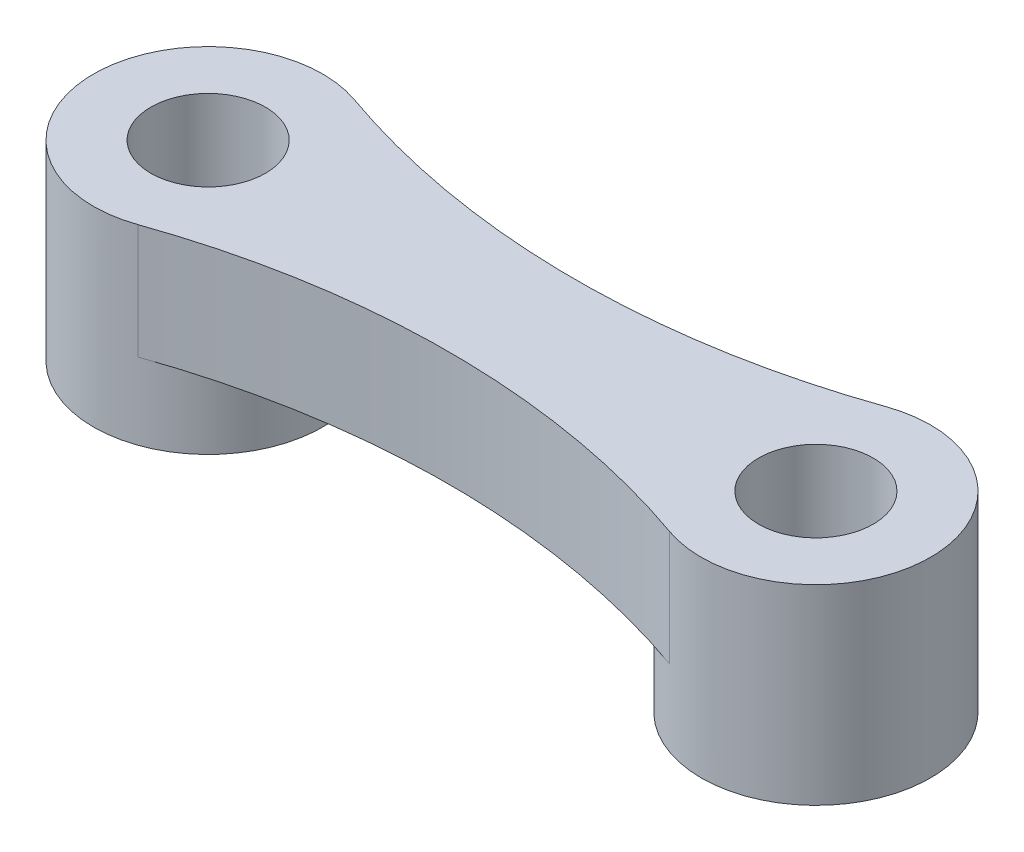
ISO-10303-21;
HEADER;
FILE_DESCRIPTION(('STEP AP214'),'2;1');
FILE_NAME('part.step','',(''),(''),'','','');
FILE_SCHEMA(('AUTOMOTIVE_DESIGN { 1 0 10303 214 1 1 1 1 }'));
ENDSEC;
DATA;
#1=APPLICATION_CONTEXT('core data for automotive mechanical design processes');
#2=APPLICATION_PROTOCOL_DEFINITION('international standard','automotive_design',2000,#1);
#3=PRODUCT_CONTEXT('',#1,'mechanical');
#4=PRODUCT('Part','Part','',(#3));
#5=PRODUCT_RELATED_PRODUCT_CATEGORY('part','',(#4));
#6=PRODUCT_DEFINITION_FORMATION('','',#4);
#7=PRODUCT_DEFINITION_CONTEXT('part definition',#1,'design');
#8=PRODUCT_DEFINITION('design','',#6,#7);
#9=PRODUCT_DEFINITION_SHAPE('','',#8);
#10=(LENGTH_UNIT() NAMED_UNIT(*) SI_UNIT(.MILLI.,.METRE.));
#11=(NAMED_UNIT(*) PLANE_ANGLE_UNIT() SI_UNIT($,.RADIAN.));
#12=(NAMED_UNIT(*) SI_UNIT($,.STERADIAN.) SOLID_ANGLE_UNIT());
#13=UNCERTAINTY_MEASURE_WITH_UNIT(LENGTH_MEASURE(1.E-05),#10,'distance_accuracy_value','');
#14=(GEOMETRIC_REPRESENTATION_CONTEXT(3) GLOBAL_UNCERTAINTY_ASSIGNED_CONTEXT((#13)) GLOBAL_UNIT_ASSIGNED_CONTEXT((#10,
#11,#12)) REPRESENTATION_CONTEXT('',''));
#15=CARTESIAN_POINT('',(0.,0.,0.));
#16=DIRECTION('',(0.,0.,1.));
#17=DIRECTION('',(1.,0.,0.));
#18=AXIS2_PLACEMENT_3D('',#15,#16,#17);
#19=CARTESIAN_POINT('',(-7.95,3.,0.));
#20=DIRECTION('',(0.,1.,0.));
#21=DIRECTION('',(0.,0.,1.));
#22=AXIS2_PLACEMENT_3D('',#19,#20,#21);
#23=PLANE('',#22);
#24=CARTESIAN_POINT('',(-7.95,3.,0.));
#25=DIRECTION('',(0.,1.,0.));
#26=DIRECTION('',(0.,0.,1.));
#27=AXIS2_PLACEMENT_3D('',#24,#25,#26);
#28=CIRCLE('',#27,1.5);
#29=CARTESIAN_POINT('',(-7.95,3.,1.5));
#30=VERTEX_POINT('',#29);
#31=EDGE_CURVE('E167',#30,#30,#28,.T.);
#32=ORIENTED_EDGE('',*,*,#31,.F.);
#33=EDGE_LOOP('',(#32));
#34=FACE_BOUND('',#33,.T.);
#35=CARTESIAN_POINT('',(7.95,3.,0.));
#36=DIRECTION('',(0.,1.,0.));
#37=DIRECTION('',(0.,0.,1.));
#38=AXIS2_PLACEMENT_3D('',#35,#36,#37);
#39=CIRCLE('',#38,1.5);
#40=CARTESIAN_POINT('',(7.95,3.,1.5));
#41=VERTEX_POINT('',#40);
#42=EDGE_CURVE('E160',#41,#41,#39,.T.);
#43=ORIENTED_EDGE('',*,*,#42,.F.);
#44=EDGE_LOOP('',(#43));
#45=FACE_BOUND('',#44,.T.);
#46=CARTESIAN_POINT('',(7.95,3.,0.));
#47=DIRECTION('',(0.,1.,0.));
#48=DIRECTION('',(0.,0.,1.));
#49=AXIS2_PLACEMENT_3D('',#46,#47,#48);
#50=CIRCLE('',#49,3.);
#51=CARTESIAN_POINT('',(6.95625,3.,2.83062907098404));
#52=VERTEX_POINT('',#51);
#53=CARTESIAN_POINT('',(6.95625000000001,3.,-2.83062907098404));
#54=VERTEX_POINT('',#53);
#55=EDGE_CURVE('E13',#52,#54,#50,.T.);
#56=ORIENTED_EDGE('',*,*,#55,.T.);
#57=CARTESIAN_POINT('',(0.,3.,-22.6450325678724));
#58=DIRECTION('',(0.,-1.,0.));
#59=DIRECTION('',(0.,0.,1.));
#60=AXIS2_PLACEMENT_3D('',#57,#58,#59);
#61=CIRCLE('',#60,21.);
#62=CARTESIAN_POINT('',(-6.95625,3.,-2.83062907098405));
#63=VERTEX_POINT('',#62);
#64=EDGE_CURVE('E152',#54,#63,#61,.T.);
#65=ORIENTED_EDGE('',*,*,#64,.T.);
#66=CARTESIAN_POINT('',(-7.95,3.,0.));
#67=DIRECTION('',(0.,1.,0.));
#68=DIRECTION('',(0.,0.,1.));
#69=AXIS2_PLACEMENT_3D('',#66,#67,#68);
#70=CIRCLE('',#69,3.);
#71=CARTESIAN_POINT('',(-6.95625,3.,2.83062907098405));
#72=VERTEX_POINT('',#71);
#73=EDGE_CURVE('E86',#63,#72,#70,.T.);
#74=ORIENTED_EDGE('',*,*,#73,.T.);
#75=CARTESIAN_POINT('',(0.,3.,22.6450325678724));
#76=DIRECTION('',(0.,-1.,0.));
#77=DIRECTION('',(0.,0.,-1.));
#78=AXIS2_PLACEMENT_3D('',#75,#76,#77);
#79=CIRCLE('',#78,21.);
#80=EDGE_CURVE('E148',#72,#52,#79,.T.);
#81=ORIENTED_EDGE('',*,*,#80,.T.);
#82=EDGE_LOOP('',(#56,#65,#74,#81));
#83=FACE_BOUND('',#82,.T.);
#84=ADVANCED_FACE('F77',(#34,#45,#83),#23,.T.);
#85=CARTESIAN_POINT('',(-7.95,0.,0.));
#86=DIRECTION('',(0.,1.,0.));
#87=DIRECTION('',(0.,0.,1.));
#88=AXIS2_PLACEMENT_3D('',#85,#86,#87);
#89=PLANE('',#88);
#90=CARTESIAN_POINT('',(0.,0.,-22.6450325678724));
#91=DIRECTION('',(0.,-1.,0.));
#92=DIRECTION('',(0.,0.,1.));
#93=AXIS2_PLACEMENT_3D('',#90,#91,#92);
#94=CIRCLE('',#93,21.);
#95=CARTESIAN_POINT('',(6.95625000000001,0.,-2.83062907098404));
#96=VERTEX_POINT('',#95);
#97=CARTESIAN_POINT('',(-6.95625,0.,-2.83062907098405));
#98=VERTEX_POINT('',#97);
#99=EDGE_CURVE('E122',#96,#98,#94,.T.);
#100=ORIENTED_EDGE('',*,*,#99,.F.);
#101=CARTESIAN_POINT('',(7.95,0.,0.));
#102=DIRECTION('',(0.,1.,0.));
#103=DIRECTION('',(0.,0.,1.));
#104=AXIS2_PLACEMENT_3D('',#101,#102,#103);
#105=CIRCLE('',#104,3.);
#106=CARTESIAN_POINT('',(6.95625,0.,2.83062907098405));
#107=VERTEX_POINT('',#106);
#108=EDGE_CURVE('E116',#96,#107,#105,.T.);
#109=ORIENTED_EDGE('',*,*,#108,.T.);
#110=CARTESIAN_POINT('',(0.,0.,22.6450325678724));
#111=DIRECTION('',(0.,-1.,0.));
#112=DIRECTION('',(0.,0.,-1.));
#113=AXIS2_PLACEMENT_3D('',#110,#111,#112);
#114=CIRCLE('',#113,21.);
#115=CARTESIAN_POINT('',(-6.95625,0.,2.83062907098405));
#116=VERTEX_POINT('',#115);
#117=EDGE_CURVE('E120',#116,#107,#114,.T.);
#118=ORIENTED_EDGE('',*,*,#117,.F.);
#119=CARTESIAN_POINT('',(-7.95,0.,0.));
#120=DIRECTION('',(0.,1.,0.));
#121=DIRECTION('',(0.,0.,1.));
#122=AXIS2_PLACEMENT_3D('',#119,#120,#121);
#123=CIRCLE('',#122,3.);
#124=EDGE_CURVE('E93',#116,#98,#123,.T.);
#125=ORIENTED_EDGE('',*,*,#124,.T.);
#126=EDGE_LOOP('',(#100,#109,#118,#125));
#127=FACE_BOUND('',#126,.T.);
#128=ADVANCED_FACE('F118',(#127),#89,.F.);
#129=CARTESIAN_POINT('',(-7.95,3.,0.));
#130=DIRECTION('',(0.,-1.,0.));
#131=DIRECTION('',(0.,0.,-1.));
#132=AXIS2_PLACEMENT_3D('',#129,#130,#131);
#133=CYLINDRICAL_SURFACE('',#132,3.);
#134=DIRECTION('',(0.,1.,0.));
#135=VECTOR('',#134,1.);
#136=CARTESIAN_POINT('',(-6.95625,0.,-2.83062907098405));
#137=LINE('',#136,#135);
#138=EDGE_CURVE('E143',#98,#63,#137,.T.);
#139=ORIENTED_EDGE('',*,*,#138,.F.);
#140=ORIENTED_EDGE('',*,*,#124,.F.);
#141=DIRECTION('',(0.,1.,0.));
#142=VECTOR('',#141,1.);
#143=CARTESIAN_POINT('',(-6.95625,0.,2.83062907098405));
#144=LINE('',#143,#142);
#145=EDGE_CURVE('E139',#116,#72,#144,.T.);
#146=ORIENTED_EDGE('',*,*,#145,.T.);
#147=ORIENTED_EDGE('',*,*,#73,.F.);
#148=EDGE_LOOP('',(#139,#140,#146,#147));
#149=FACE_BOUND('',#148,.T.);
#150=CARTESIAN_POINT('',(-7.95,-2.,0.));
#151=DIRECTION('',(0.,1.,0.));
#152=DIRECTION('',(0.,0.,1.));
#153=AXIS2_PLACEMENT_3D('',#150,#151,#152);
#154=CIRCLE('',#153,3.);
#155=CARTESIAN_POINT('',(-7.95,-2.,3.));
#156=VERTEX_POINT('',#155);
#157=EDGE_CURVE('E156',#156,#156,#154,.T.);
#158=ORIENTED_EDGE('',*,*,#157,.T.);
#159=EDGE_LOOP('',(#158));
#160=FACE_BOUND('',#159,.T.);
#161=ADVANCED_FACE('F79',(#149,#160),#133,.T.);
#162=CARTESIAN_POINT('',(7.95,3.,0.));
#163=DIRECTION('',(0.,-1.,0.));
#164=DIRECTION('',(0.,0.,-1.));
#165=AXIS2_PLACEMENT_3D('',#162,#163,#164);
#166=CYLINDRICAL_SURFACE('',#165,3.);
#167=DIRECTION('',(0.,1.,0.));
#168=VECTOR('',#167,1.);
#169=CARTESIAN_POINT('',(6.95625,0.,2.83062907098404));
#170=LINE('',#169,#168);
#171=EDGE_CURVE('E131',#107,#52,#170,.T.);
#172=ORIENTED_EDGE('',*,*,#171,.F.);
#173=ORIENTED_EDGE('',*,*,#108,.F.);
#174=DIRECTION('',(0.,1.,0.));
#175=VECTOR('',#174,1.);
#176=CARTESIAN_POINT('',(6.95625000000001,0.,-2.83062907098404));
#177=LINE('',#176,#175);
#178=EDGE_CURVE('E138',#96,#54,#177,.T.);
#179=ORIENTED_EDGE('',*,*,#178,.T.);
#180=ORIENTED_EDGE('',*,*,#55,.F.);
#181=EDGE_LOOP('',(#172,#173,#179,#180));
#182=FACE_BOUND('',#181,.T.);
#183=CARTESIAN_POINT('',(7.95,-2.,0.));
#184=DIRECTION('',(0.,1.,0.));
#185=DIRECTION('',(0.,0.,1.));
#186=AXIS2_PLACEMENT_3D('',#183,#184,#185);
#187=CIRCLE('',#186,3.);
#188=CARTESIAN_POINT('',(7.95,-2.,3.));
#189=VERTEX_POINT('',#188);
#190=EDGE_CURVE('E127',#189,#189,#187,.T.);
#191=ORIENTED_EDGE('',*,*,#190,.T.);
#192=EDGE_LOOP('',(#191));
#193=FACE_BOUND('',#192,.T.);
#194=ADVANCED_FACE('F132',(#182,#193),#166,.T.);
#195=CARTESIAN_POINT('',(-7.95,3.,0.));
#196=DIRECTION('',(0.,-1.,0.));
#197=DIRECTION('',(0.,0.,-1.));
#198=AXIS2_PLACEMENT_3D('',#195,#196,#197);
#199=CYLINDRICAL_SURFACE('',#198,1.5);
#200=ORIENTED_EDGE('',*,*,#31,.T.);
#201=EDGE_LOOP('',(#200));
#202=FACE_BOUND('',#201,.T.);
#203=CARTESIAN_POINT('',(-7.95,-2.,0.));
#204=DIRECTION('',(0.,1.,0.));
#205=DIRECTION('',(0.,0.,1.));
#206=AXIS2_PLACEMENT_3D('',#203,#204,#205);
#207=CIRCLE('',#206,1.5);
#208=CARTESIAN_POINT('',(-7.95,-2.,1.5));
#209=VERTEX_POINT('',#208);
#210=EDGE_CURVE('E181',#209,#209,#207,.T.);
#211=ORIENTED_EDGE('',*,*,#210,.F.);
#212=EDGE_LOOP('',(#211));
#213=FACE_BOUND('',#212,.T.);
#214=ADVANCED_FACE('F199',(#202,#213),#199,.F.);
#215=CARTESIAN_POINT('',(7.95,3.,0.));
#216=DIRECTION('',(0.,-1.,0.));
#217=DIRECTION('',(0.,0.,-1.));
#218=AXIS2_PLACEMENT_3D('',#215,#216,#217);
#219=CYLINDRICAL_SURFACE('',#218,1.5);
#220=ORIENTED_EDGE('',*,*,#42,.T.);
#221=EDGE_LOOP('',(#220));
#222=FACE_BOUND('',#221,.T.);
#223=CARTESIAN_POINT('',(7.95,-2.,0.));
#224=DIRECTION('',(0.,1.,0.));
#225=DIRECTION('',(0.,0.,1.));
#226=AXIS2_PLACEMENT_3D('',#223,#224,#225);
#227=CIRCLE('',#226,1.5);
#228=CARTESIAN_POINT('',(7.95,-2.,1.5));
#229=VERTEX_POINT('',#228);
#230=EDGE_CURVE('E128',#229,#229,#227,.T.);
#231=ORIENTED_EDGE('',*,*,#230,.F.);
#232=EDGE_LOOP('',(#231));
#233=FACE_BOUND('',#232,.T.);
#234=ADVANCED_FACE('F196',(#222,#233),#219,.F.);
#235=CARTESIAN_POINT('',(0.,0.,-22.6450325678724));
#236=DIRECTION('',(0.,1.,0.));
#237=DIRECTION('',(0.,0.,1.));
#238=AXIS2_PLACEMENT_3D('',#235,#236,#237);
#239=CYLINDRICAL_SURFACE('',#238,21.);
#240=ORIENTED_EDGE('',*,*,#64,.F.);
#241=ORIENTED_EDGE('',*,*,#178,.F.);
#242=ORIENTED_EDGE('',*,*,#99,.T.);
#243=ORIENTED_EDGE('',*,*,#138,.T.);
#244=EDGE_LOOP('',(#240,#241,#242,#243));
#245=FACE_BOUND('',#244,.T.);
#246=ADVANCED_FACE('F198',(#245),#239,.F.);
#247=CARTESIAN_POINT('',(0.,0.,22.6450325678724));
#248=DIRECTION('',(0.,1.,0.));
#249=DIRECTION('',(0.,0.,1.));
#250=AXIS2_PLACEMENT_3D('',#247,#248,#249);
#251=CYLINDRICAL_SURFACE('',#250,21.);
#252=ORIENTED_EDGE('',*,*,#80,.F.);
#253=ORIENTED_EDGE('',*,*,#145,.F.);
#254=ORIENTED_EDGE('',*,*,#117,.T.);
#255=ORIENTED_EDGE('',*,*,#171,.T.);
#256=EDGE_LOOP('',(#252,#253,#254,#255));
#257=FACE_BOUND('',#256,.T.);
#258=ADVANCED_FACE('F141',(#257),#251,.F.);
#259=CARTESIAN_POINT('',(-7.95,-2.,0.));
#260=DIRECTION('',(0.,1.,0.));
#261=DIRECTION('',(0.,0.,1.));
#262=AXIS2_PLACEMENT_3D('',#259,#260,#261);
#263=PLANE('',#262);
#264=ORIENTED_EDGE('',*,*,#210,.T.);
#265=EDGE_LOOP('',(#264));
#266=FACE_BOUND('',#265,.T.);
#267=ORIENTED_EDGE('',*,*,#157,.F.);
#268=EDGE_LOOP('',(#267));
#269=FACE_BOUND('',#268,.T.);
#270=ADVANCED_FACE('F251',(#266,#269),#263,.F.);
#271=CARTESIAN_POINT('',(7.95,-2.,0.));
#272=DIRECTION('',(0.,1.,0.));
#273=DIRECTION('',(0.,0.,1.));
#274=AXIS2_PLACEMENT_3D('',#271,#272,#273);
#275=PLANE('',#274);
#276=ORIENTED_EDGE('',*,*,#230,.T.);
#277=EDGE_LOOP('',(#276));
#278=FACE_BOUND('',#277,.T.);
#279=ORIENTED_EDGE('',*,*,#190,.F.);
#280=EDGE_LOOP('',(#279));
#281=FACE_BOUND('',#280,.T.);
#282=ADVANCED_FACE('F193',(#278,#281),#275,.F.);
#283=CLOSED_SHELL('',(#84,#128,#161,#194,#214,#234,#246,#258,#270,#282));
#284=MANIFOLD_SOLID_BREP('B2',#283);
#285=ADVANCED_BREP_SHAPE_REPRESENTATION('',(#18,#284),#14);
#286=SHAPE_DEFINITION_REPRESENTATION(#9,#285);
ENDSEC;
END-ISO-10303-21;
